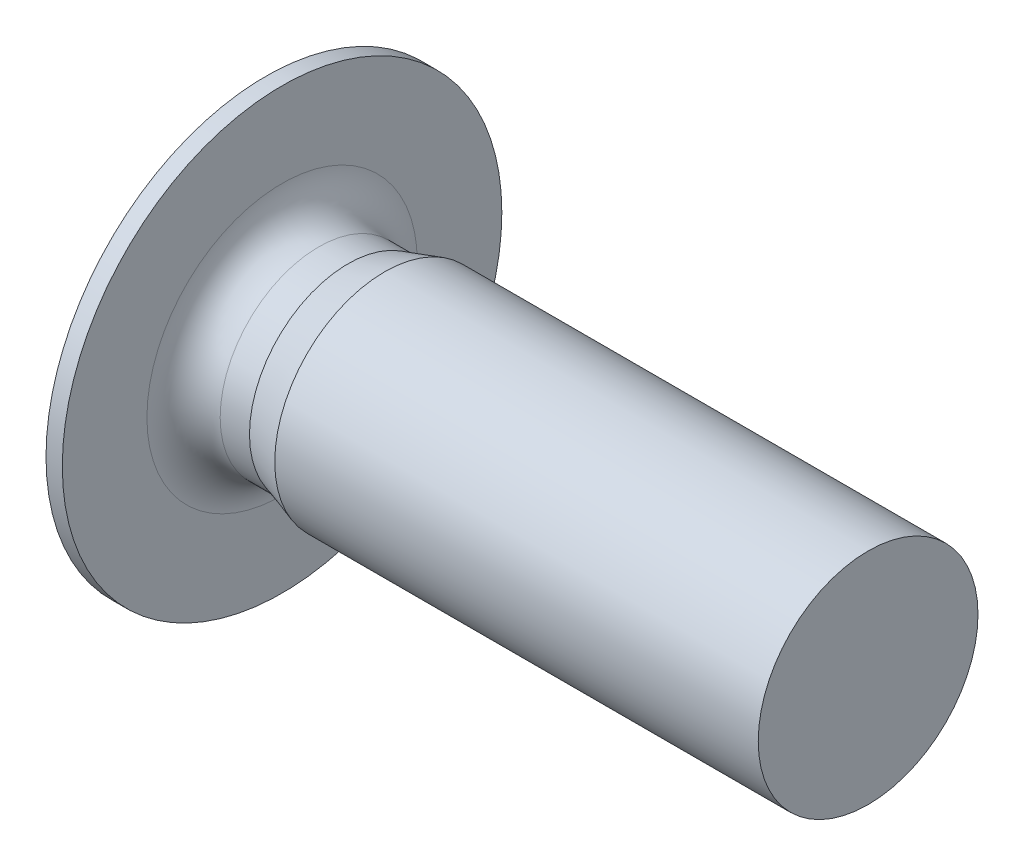
ISO-10303-21;
HEADER;
FILE_DESCRIPTION(('STEP AP214'),'2;1');
FILE_NAME('part.step','',(''),(''),'','','');
FILE_SCHEMA(('AUTOMOTIVE_DESIGN { 1 0 10303 214 1 1 1 1 }'));
ENDSEC;
DATA;
#1=APPLICATION_CONTEXT('core data for automotive mechanical design processes');
#2=APPLICATION_PROTOCOL_DEFINITION('international standard','automotive_design',2000,#1);
#3=PRODUCT_CONTEXT('',#1,'mechanical');
#4=PRODUCT('Part','Part','',(#3));
#5=PRODUCT_RELATED_PRODUCT_CATEGORY('part','',(#4));
#6=PRODUCT_DEFINITION_FORMATION('','',#4);
#7=PRODUCT_DEFINITION_CONTEXT('part definition',#1,'design');
#8=PRODUCT_DEFINITION('design','',#6,#7);
#9=PRODUCT_DEFINITION_SHAPE('','',#8);
#10=(LENGTH_UNIT() NAMED_UNIT(*) SI_UNIT(.MILLI.,.METRE.));
#11=(NAMED_UNIT(*) PLANE_ANGLE_UNIT() SI_UNIT($,.RADIAN.));
#12=(NAMED_UNIT(*) SI_UNIT($,.STERADIAN.) SOLID_ANGLE_UNIT());
#13=UNCERTAINTY_MEASURE_WITH_UNIT(LENGTH_MEASURE(1.E-05),#10,'distance_accuracy_value','');
#14=(GEOMETRIC_REPRESENTATION_CONTEXT(3) GLOBAL_UNCERTAINTY_ASSIGNED_CONTEXT((#13)) GLOBAL_UNIT_ASSIGNED_CONTEXT((#10,
#11,#12)) REPRESENTATION_CONTEXT('',''));
#15=CARTESIAN_POINT('',(0.,0.,0.));
#16=DIRECTION('',(0.,0.,1.));
#17=DIRECTION('',(1.,0.,0.));
#18=AXIS2_PLACEMENT_3D('',#15,#16,#17);
#19=CARTESIAN_POINT('',(0.5,0.,0.));
#20=DIRECTION('',(-1.,0.,0.));
#21=DIRECTION('',(0.,0.,1.));
#22=AXIS2_PLACEMENT_3D('',#19,#20,#21);
#23=TOROIDAL_SURFACE('',#22,1.845,0.5);
#24=CARTESIAN_POINT('',(0.5,0.,0.));
#25=DIRECTION('',(1.,0.,0.));
#26=DIRECTION('',(0.,0.,1.));
#27=AXIS2_PLACEMENT_3D('',#24,#25,#26);
#28=CIRCLE('',#27,1.345);
#29=CARTESIAN_POINT('',(0.5,0.,1.345));
#30=VERTEX_POINT('',#29);
#31=EDGE_CURVE('E259',#30,#30,#28,.T.);
#32=ORIENTED_EDGE('',*,*,#31,.F.);
#33=EDGE_LOOP('',(#32));
#34=FACE_BOUND('',#33,.T.);
#35=CARTESIAN_POINT('',(0.,0.,0.));
#36=DIRECTION('',(-1.,0.,0.));
#37=DIRECTION('',(0.,0.,1.));
#38=AXIS2_PLACEMENT_3D('',#35,#36,#37);
#39=CIRCLE('',#38,1.845);
#40=CARTESIAN_POINT('',(0.,0.,1.845));
#41=VERTEX_POINT('',#40);
#42=EDGE_CURVE('E215',#41,#41,#39,.T.);
#43=ORIENTED_EDGE('',*,*,#42,.F.);
#44=EDGE_LOOP('',(#43));
#45=FACE_BOUND('',#44,.T.);
#46=ADVANCED_FACE('F16',(#34,#45),#23,.F.);
#47=CARTESIAN_POINT('',(0.2,0.,0.));
#48=DIRECTION('',(-1.,0.,0.));
#49=DIRECTION('',(0.,-1.,0.));
#50=AXIS2_PLACEMENT_3D('',#47,#48,#49);
#51=CONICAL_SURFACE('',#50,0.75,1.02974425867665);
#52=CARTESIAN_POINT('',(0.650645464270675,0.,0.));
#53=VERTEX_POINT('',#52);
#54=VERTEX_LOOP('',#53);
#55=FACE_BOUND('',#54,.T.);
#56=CARTESIAN_POINT('',(0.2,0.,0.));
#57=DIRECTION('',(1.,0.,0.));
#58=DIRECTION('',(0.,1.,0.));
#59=AXIS2_PLACEMENT_3D('',#56,#57,#58);
#60=CIRCLE('',#59,0.75);
#61=CARTESIAN_POINT('',(0.2,0.75,0.));
#62=VERTEX_POINT('',#61);
#63=CARTESIAN_POINT('',(0.2,0.375,0.649519052838329));
#64=VERTEX_POINT('',#63);
#65=EDGE_CURVE('E227',#62,#64,#60,.T.);
#66=ORIENTED_EDGE('',*,*,#65,.F.);
#67=CARTESIAN_POINT('',(0.2,0.,0.));
#68=DIRECTION('',(1.,0.,0.));
#69=DIRECTION('',(0.,0.,1.));
#70=AXIS2_PLACEMENT_3D('',#67,#68,#69);
#71=CIRCLE('',#70,0.75);
#72=CARTESIAN_POINT('',(0.2,0.375,-0.649519052838329));
#73=VERTEX_POINT('',#72);
#74=EDGE_CURVE('E178',#73,#62,#71,.T.);
#75=ORIENTED_EDGE('',*,*,#74,.F.);
#76=CARTESIAN_POINT('',(0.2,0.,0.));
#77=DIRECTION('',(1.,0.,0.));
#78=DIRECTION('',(0.,0.,1.));
#79=AXIS2_PLACEMENT_3D('',#76,#77,#78);
#80=CIRCLE('',#79,0.75);
#81=CARTESIAN_POINT('',(0.2,-0.375,-0.649519052838329));
#82=VERTEX_POINT('',#81);
#83=EDGE_CURVE('E177',#82,#73,#80,.T.);
#84=ORIENTED_EDGE('',*,*,#83,.F.);
#85=CARTESIAN_POINT('',(0.2,0.,0.));
#86=DIRECTION('',(1.,0.,0.));
#87=DIRECTION('',(0.,0.,1.));
#88=AXIS2_PLACEMENT_3D('',#85,#86,#87);
#89=CIRCLE('',#88,0.75);
#90=CARTESIAN_POINT('',(0.2,-0.75,0.));
#91=VERTEX_POINT('',#90);
#92=EDGE_CURVE('E197',#91,#82,#89,.T.);
#93=ORIENTED_EDGE('',*,*,#92,.F.);
#94=CARTESIAN_POINT('',(0.2,0.,0.));
#95=DIRECTION('',(1.,0.,0.));
#96=DIRECTION('',(0.,0.,1.));
#97=AXIS2_PLACEMENT_3D('',#94,#95,#96);
#98=CIRCLE('',#97,0.75);
#99=CARTESIAN_POINT('',(0.2,-0.375,0.649519052838329));
#100=VERTEX_POINT('',#99);
#101=EDGE_CURVE('E163',#100,#91,#98,.T.);
#102=ORIENTED_EDGE('',*,*,#101,.F.);
#103=CARTESIAN_POINT('',(0.2,0.,0.));
#104=DIRECTION('',(1.,0.,0.));
#105=DIRECTION('',(0.,0.,1.));
#106=AXIS2_PLACEMENT_3D('',#103,#104,#105);
#107=CIRCLE('',#106,0.75);
#108=EDGE_CURVE('E10',#64,#100,#107,.T.);
#109=ORIENTED_EDGE('',*,*,#108,.F.);
#110=EDGE_LOOP('',(#66,#75,#84,#93,#102,#109));
#111=FACE_BOUND('',#110,.T.);
#112=ADVANCED_FACE('F310',(#55,#111),#51,.F.);
#113=CARTESIAN_POINT('',(0.2,0.,0.));
#114=DIRECTION('',(-1.,0.,0.));
#115=DIRECTION('',(0.,0.,1.));
#116=AXIS2_PLACEMENT_3D('',#113,#114,#115);
#117=PLANE('',#116);
#118=DIRECTION('',(0.,0.866025403784439,-0.5));
#119=VECTOR('',#118,1.);
#120=CARTESIAN_POINT('',(0.2,0.,0.866025403784439));
#121=LINE('',#120,#119);
#122=CARTESIAN_POINT('',(0.2,0.,0.866025403784439));
#123=VERTEX_POINT('',#122);
#124=EDGE_CURVE('E275',#123,#64,#121,.T.);
#125=ORIENTED_EDGE('',*,*,#124,.T.);
#126=ORIENTED_EDGE('',*,*,#108,.T.);
#127=DIRECTION('',(0.,0.866025403784439,0.5));
#128=VECTOR('',#127,1.);
#129=CARTESIAN_POINT('',(0.2,-0.75,0.433012701892219));
#130=LINE('',#129,#128);
#131=EDGE_CURVE('E39',#100,#123,#130,.T.);
#132=ORIENTED_EDGE('',*,*,#131,.T.);
#133=EDGE_LOOP('',(#125,#126,#132));
#134=FACE_BOUND('',#133,.T.);
#135=ADVANCED_FACE('F308',(#134),#117,.T.);
#136=CARTESIAN_POINT('',(0.2,0.,-0.866025403784439));
#137=DIRECTION('',(0.,-0.5,-0.866025403784439));
#138=DIRECTION('',(0.,-0.866025403784439,0.5));
#139=AXIS2_PLACEMENT_3D('',#136,#137,#138);
#140=PLANE('',#139);
#141=DIRECTION('',(0.,-0.866025403784439,0.5));
#142=VECTOR('',#141,1.);
#143=CARTESIAN_POINT('',(-0.8,0.,-0.866025403784439));
#144=LINE('',#143,#142);
#145=CARTESIAN_POINT('',(-0.8,0.,-0.866025403784439));
#146=VERTEX_POINT('',#145);
#147=CARTESIAN_POINT('',(-0.8,-0.75,-0.43301270189222));
#148=VERTEX_POINT('',#147);
#149=EDGE_CURVE('E191',#146,#148,#144,.T.);
#150=ORIENTED_EDGE('',*,*,#149,.T.);
#151=DIRECTION('',(-1.,0.,0.));
#152=VECTOR('',#151,1.);
#153=CARTESIAN_POINT('',(0.2,-0.75,-0.43301270189222));
#154=LINE('',#153,#152);
#155=CARTESIAN_POINT('',(0.2,-0.75,-0.43301270189222));
#156=VERTEX_POINT('',#155);
#157=EDGE_CURVE('E24',#156,#148,#154,.T.);
#158=ORIENTED_EDGE('',*,*,#157,.F.);
#159=DIRECTION('',(0.,-0.866025403784439,0.5));
#160=VECTOR('',#159,1.);
#161=CARTESIAN_POINT('',(0.2,0.,-0.866025403784439));
#162=LINE('',#161,#160);
#163=EDGE_CURVE('E193',#82,#156,#162,.T.);
#164=ORIENTED_EDGE('',*,*,#163,.F.);
#165=DIRECTION('',(0.,-0.866025403784439,0.5));
#166=VECTOR('',#165,1.);
#167=CARTESIAN_POINT('',(0.2,0.,-0.866025403784439));
#168=LINE('',#167,#166);
#169=CARTESIAN_POINT('',(0.2,0.,-0.866025403784439));
#170=VERTEX_POINT('',#169);
#171=EDGE_CURVE('E196',#170,#82,#168,.T.);
#172=ORIENTED_EDGE('',*,*,#171,.F.);
#173=DIRECTION('',(-1.,0.,0.));
#174=VECTOR('',#173,1.);
#175=CARTESIAN_POINT('',(0.2,0.,-0.866025403784439));
#176=LINE('',#175,#174);
#177=EDGE_CURVE('E266',#170,#146,#176,.T.);
#178=ORIENTED_EDGE('',*,*,#177,.T.);
#179=EDGE_LOOP('',(#150,#158,#164,#172,#178));
#180=FACE_BOUND('',#179,.T.);
#181=ADVANCED_FACE('F293',(#180),#140,.F.);
#182=CARTESIAN_POINT('',(0.2,-0.75,-0.43301270189222));
#183=DIRECTION('',(0.,-1.,0.));
#184=DIRECTION('',(0.,0.,-1.));
#185=AXIS2_PLACEMENT_3D('',#182,#183,#184);
#186=PLANE('',#185);
#187=DIRECTION('',(0.,0.,1.));
#188=VECTOR('',#187,1.);
#189=CARTESIAN_POINT('',(-0.8,-0.75,-0.43301270189222));
#190=LINE('',#189,#188);
#191=CARTESIAN_POINT('',(-0.8,-0.75,0.433012701892219));
#192=VERTEX_POINT('',#191);
#193=EDGE_CURVE('E151',#148,#192,#190,.T.);
#194=ORIENTED_EDGE('',*,*,#193,.T.);
#195=DIRECTION('',(-1.,0.,0.));
#196=VECTOR('',#195,1.);
#197=CARTESIAN_POINT('',(0.2,-0.75,0.433012701892219));
#198=LINE('',#197,#196);
#199=CARTESIAN_POINT('',(0.2,-0.75,0.433012701892219));
#200=VERTEX_POINT('',#199);
#201=EDGE_CURVE('E144',#200,#192,#198,.T.);
#202=ORIENTED_EDGE('',*,*,#201,.F.);
#203=DIRECTION('',(0.,0.,1.));
#204=VECTOR('',#203,1.);
#205=CARTESIAN_POINT('',(0.2,-0.75,-0.43301270189222));
#206=LINE('',#205,#204);
#207=EDGE_CURVE('E148',#91,#200,#206,.T.);
#208=ORIENTED_EDGE('',*,*,#207,.F.);
#209=DIRECTION('',(0.,0.,1.));
#210=VECTOR('',#209,1.);
#211=CARTESIAN_POINT('',(0.2,-0.75,-0.43301270189222));
#212=LINE('',#211,#210);
#213=EDGE_CURVE('E165',#156,#91,#212,.T.);
#214=ORIENTED_EDGE('',*,*,#213,.F.);
#215=ORIENTED_EDGE('',*,*,#157,.T.);
#216=EDGE_LOOP('',(#194,#202,#208,#214,#215));
#217=FACE_BOUND('',#216,.T.);
#218=ADVANCED_FACE('F146',(#217),#186,.F.);
#219=CARTESIAN_POINT('',(0.2,-0.75,0.433012701892219));
#220=DIRECTION('',(0.,-0.5,0.866025403784439));
#221=DIRECTION('',(-1.,0.,0.));
#222=AXIS2_PLACEMENT_3D('',#219,#220,#221);
#223=PLANE('',#222);
#224=DIRECTION('',(0.,0.866025403784439,0.5));
#225=VECTOR('',#224,1.);
#226=CARTESIAN_POINT('',(-0.8,-0.75,0.433012701892219));
#227=LINE('',#226,#225);
#228=CARTESIAN_POINT('',(-0.8,0.,0.866025403784439));
#229=VERTEX_POINT('',#228);
#230=EDGE_CURVE('E249',#192,#229,#227,.T.);
#231=ORIENTED_EDGE('',*,*,#230,.T.);
#232=DIRECTION('',(-1.,0.,0.));
#233=VECTOR('',#232,1.);
#234=CARTESIAN_POINT('',(0.2,0.,0.866025403784439));
#235=LINE('',#234,#233);
#236=EDGE_CURVE('E278',#123,#229,#235,.T.);
#237=ORIENTED_EDGE('',*,*,#236,.F.);
#238=ORIENTED_EDGE('',*,*,#131,.F.);
#239=DIRECTION('',(0.,0.866025403784439,0.5));
#240=VECTOR('',#239,1.);
#241=CARTESIAN_POINT('',(0.2,-0.75,0.433012701892219));
#242=LINE('',#241,#240);
#243=EDGE_CURVE('E161',#200,#100,#242,.T.);
#244=ORIENTED_EDGE('',*,*,#243,.F.);
#245=ORIENTED_EDGE('',*,*,#201,.T.);
#246=EDGE_LOOP('',(#231,#237,#238,#244,#245));
#247=FACE_BOUND('',#246,.T.);
#248=ADVANCED_FACE('F167',(#247),#223,.F.);
#249=CARTESIAN_POINT('',(0.2,0.,0.866025403784439));
#250=DIRECTION('',(0.,0.5,0.866025403784439));
#251=DIRECTION('',(1.,0.,0.));
#252=AXIS2_PLACEMENT_3D('',#249,#250,#251);
#253=PLANE('',#252);
#254=DIRECTION('',(0.,0.866025403784439,-0.5));
#255=VECTOR('',#254,1.);
#256=CARTESIAN_POINT('',(-0.8,0.,0.866025403784439));
#257=LINE('',#256,#255);
#258=CARTESIAN_POINT('',(-0.8,0.75,0.43301270189222));
#259=VERTEX_POINT('',#258);
#260=EDGE_CURVE('E245',#229,#259,#257,.T.);
#261=ORIENTED_EDGE('',*,*,#260,.T.);
#262=DIRECTION('',(-1.,0.,0.));
#263=VECTOR('',#262,1.);
#264=CARTESIAN_POINT('',(0.2,0.75,0.43301270189222));
#265=LINE('',#264,#263);
#266=CARTESIAN_POINT('',(0.2,0.75,0.43301270189222));
#267=VERTEX_POINT('',#266);
#268=EDGE_CURVE('E272',#267,#259,#265,.T.);
#269=ORIENTED_EDGE('',*,*,#268,.F.);
#270=DIRECTION('',(0.,0.866025403784439,-0.5));
#271=VECTOR('',#270,1.);
#272=CARTESIAN_POINT('',(0.2,0.,0.866025403784439));
#273=LINE('',#272,#271);
#274=EDGE_CURVE('E192',#64,#267,#273,.T.);
#275=ORIENTED_EDGE('',*,*,#274,.F.);
#276=ORIENTED_EDGE('',*,*,#124,.F.);
#277=ORIENTED_EDGE('',*,*,#236,.T.);
#278=EDGE_LOOP('',(#261,#269,#275,#276,#277));
#279=FACE_BOUND('',#278,.T.);
#280=ADVANCED_FACE('F306',(#279),#253,.F.);
#281=CARTESIAN_POINT('',(0.2,0.75,0.43301270189222));
#282=DIRECTION('',(0.,1.,0.));
#283=DIRECTION('',(1.,0.,0.));
#284=AXIS2_PLACEMENT_3D('',#281,#282,#283);
#285=PLANE('',#284);
#286=DIRECTION('',(0.,0.,-1.));
#287=VECTOR('',#286,1.);
#288=CARTESIAN_POINT('',(-0.8,0.75,0.43301270189222));
#289=LINE('',#288,#287);
#290=CARTESIAN_POINT('',(-0.8,0.75,-0.43301270189222));
#291=VERTEX_POINT('',#290);
#292=EDGE_CURVE('E241',#259,#291,#289,.T.);
#293=ORIENTED_EDGE('',*,*,#292,.T.);
#294=DIRECTION('',(-1.,0.,0.));
#295=VECTOR('',#294,1.);
#296=CARTESIAN_POINT('',(0.2,0.75,-0.43301270189222));
#297=LINE('',#296,#295);
#298=CARTESIAN_POINT('',(0.2,0.75,-0.43301270189222));
#299=VERTEX_POINT('',#298);
#300=EDGE_CURVE('E269',#299,#291,#297,.T.);
#301=ORIENTED_EDGE('',*,*,#300,.F.);
#302=DIRECTION('',(0.,0.,-1.));
#303=VECTOR('',#302,1.);
#304=CARTESIAN_POINT('',(0.2,0.75,0.43301270189222));
#305=LINE('',#304,#303);
#306=EDGE_CURVE('E182',#62,#299,#305,.T.);
#307=ORIENTED_EDGE('',*,*,#306,.F.);
#308=DIRECTION('',(0.,0.,-1.));
#309=VECTOR('',#308,1.);
#310=CARTESIAN_POINT('',(0.2,0.75,0.43301270189222));
#311=LINE('',#310,#309);
#312=EDGE_CURVE('E223',#267,#62,#311,.T.);
#313=ORIENTED_EDGE('',*,*,#312,.F.);
#314=ORIENTED_EDGE('',*,*,#268,.T.);
#315=EDGE_LOOP('',(#293,#301,#307,#313,#314));
#316=FACE_BOUND('',#315,.T.);
#317=ADVANCED_FACE('F301',(#316),#285,.F.);
#318=CARTESIAN_POINT('',(0.2,0.75,-0.43301270189222));
#319=DIRECTION('',(0.,0.5,-0.866025403784439));
#320=DIRECTION('',(-1.,0.,0.));
#321=AXIS2_PLACEMENT_3D('',#318,#319,#320);
#322=PLANE('',#321);
#323=DIRECTION('',(0.,-0.866025403784439,-0.5));
#324=VECTOR('',#323,1.);
#325=CARTESIAN_POINT('',(-0.8,0.75,-0.43301270189222));
#326=LINE('',#325,#324);
#327=EDGE_CURVE('E237',#291,#146,#326,.T.);
#328=ORIENTED_EDGE('',*,*,#327,.T.);
#329=ORIENTED_EDGE('',*,*,#177,.F.);
#330=DIRECTION('',(0.,-0.866025403784439,-0.5));
#331=VECTOR('',#330,1.);
#332=CARTESIAN_POINT('',(0.2,0.75,-0.43301270189222));
#333=LINE('',#332,#331);
#334=EDGE_CURVE('E208',#73,#170,#333,.T.);
#335=ORIENTED_EDGE('',*,*,#334,.F.);
#336=DIRECTION('',(0.,-0.866025403784439,-0.5));
#337=VECTOR('',#336,1.);
#338=CARTESIAN_POINT('',(0.2,0.75,-0.43301270189222));
#339=LINE('',#338,#337);
#340=EDGE_CURVE('E183',#299,#73,#339,.T.);
#341=ORIENTED_EDGE('',*,*,#340,.F.);
#342=ORIENTED_EDGE('',*,*,#300,.T.);
#343=EDGE_LOOP('',(#328,#329,#335,#341,#342));
#344=FACE_BOUND('',#343,.T.);
#345=ADVANCED_FACE('F297',(#344),#322,.F.);
#346=CARTESIAN_POINT('',(-0.222649730810374,0.,0.));
#347=DIRECTION('',(1.,0.,0.));
#348=DIRECTION('',(0.,0.,-1.));
#349=AXIS2_PLACEMENT_3D('',#346,#347,#348);
#350=CONICAL_SURFACE('',#349,3.,1.0471975511966);
#351=CARTESIAN_POINT('',(-0.8,0.,0.));
#352=DIRECTION('',(-1.,0.,0.));
#353=DIRECTION('',(0.,0.,1.));
#354=AXIS2_PLACEMENT_3D('',#351,#352,#353);
#355=CIRCLE('',#354,2.);
#356=CARTESIAN_POINT('',(-0.8,0.,2.));
#357=VERTEX_POINT('',#356);
#358=EDGE_CURVE('E188',#357,#357,#355,.T.);
#359=ORIENTED_EDGE('',*,*,#358,.F.);
#360=EDGE_LOOP('',(#359));
#361=FACE_BOUND('',#360,.T.);
#362=CARTESIAN_POINT('',(-0.222649730810374,0.,0.));
#363=DIRECTION('',(-1.,0.,0.));
#364=DIRECTION('',(0.,0.,1.));
#365=AXIS2_PLACEMENT_3D('',#362,#363,#364);
#366=CIRCLE('',#365,3.);
#367=CARTESIAN_POINT('',(-0.222649730810374,0.,3.));
#368=VERTEX_POINT('',#367);
#369=EDGE_CURVE('E218',#368,#368,#366,.T.);
#370=ORIENTED_EDGE('',*,*,#369,.T.);
#371=EDGE_LOOP('',(#370));
#372=FACE_BOUND('',#371,.T.);
#373=ADVANCED_FACE('F345',(#361,#372),#350,.T.);
#374=CARTESIAN_POINT('',(-0.8,0.,0.));
#375=DIRECTION('',(-1.,0.,0.));
#376=DIRECTION('',(0.,0.,1.));
#377=AXIS2_PLACEMENT_3D('',#374,#375,#376);
#378=CYLINDRICAL_SURFACE('',#377,3.);
#379=ORIENTED_EDGE('',*,*,#369,.F.);
#380=EDGE_LOOP('',(#379));
#381=FACE_BOUND('',#380,.T.);
#382=CARTESIAN_POINT('',(0.,0.,0.));
#383=DIRECTION('',(-1.,0.,0.));
#384=DIRECTION('',(0.,0.,1.));
#385=AXIS2_PLACEMENT_3D('',#382,#383,#384);
#386=CIRCLE('',#385,3.);
#387=CARTESIAN_POINT('',(0.,0.,3.));
#388=VERTEX_POINT('',#387);
#389=EDGE_CURVE('E219',#388,#388,#386,.T.);
#390=ORIENTED_EDGE('',*,*,#389,.T.);
#391=EDGE_LOOP('',(#390));
#392=FACE_BOUND('',#391,.T.);
#393=ADVANCED_FACE('F341',(#381,#392),#378,.T.);
#394=CARTESIAN_POINT('',(0.,1.345,0.));
#395=DIRECTION('',(-1.,0.,0.));
#396=DIRECTION('',(0.,0.,1.));
#397=AXIS2_PLACEMENT_3D('',#394,#395,#396);
#398=PLANE('',#397);
#399=ORIENTED_EDGE('',*,*,#42,.T.);
#400=EDGE_LOOP('',(#399));
#401=FACE_BOUND('',#400,.T.);
#402=ORIENTED_EDGE('',*,*,#389,.F.);
#403=EDGE_LOOP('',(#402));
#404=FACE_BOUND('',#403,.T.);
#405=ADVANCED_FACE('F337',(#401,#404),#398,.F.);
#406=CARTESIAN_POINT('',(-0.8,0.,0.));
#407=DIRECTION('',(-1.,0.,0.));
#408=DIRECTION('',(0.,0.,1.));
#409=AXIS2_PLACEMENT_3D('',#406,#407,#408);
#410=CYLINDRICAL_SURFACE('',#409,1.345);
#411=ORIENTED_EDGE('',*,*,#31,.T.);
#412=EDGE_LOOP('',(#411));
#413=FACE_BOUND('',#412,.T.);
#414=CARTESIAN_POINT('',(0.9,0.,0.));
#415=DIRECTION('',(-1.,0.,0.));
#416=DIRECTION('',(0.,0.,1.));
#417=AXIS2_PLACEMENT_3D('',#414,#415,#416);
#418=CIRCLE('',#417,1.345);
#419=CARTESIAN_POINT('',(0.9,0.,1.345));
#420=VERTEX_POINT('',#419);
#421=EDGE_CURVE('E256',#420,#420,#418,.T.);
#422=ORIENTED_EDGE('',*,*,#421,.T.);
#423=EDGE_LOOP('',(#422));
#424=FACE_BOUND('',#423,.T.);
#425=ADVANCED_FACE('F340',(#413,#424),#410,.T.);
#426=CARTESIAN_POINT('',(1.4,0.,0.));
#427=DIRECTION('',(1.,0.,0.));
#428=DIRECTION('',(0.,0.,-1.));
#429=AXIS2_PLACEMENT_3D('',#426,#427,#428);
#430=CONICAL_SURFACE('',#429,1.5,0.300605670042395);
#431=ORIENTED_EDGE('',*,*,#421,.F.);
#432=EDGE_LOOP('',(#431));
#433=FACE_BOUND('',#432,.T.);
#434=CARTESIAN_POINT('',(1.4,0.,0.));
#435=DIRECTION('',(-1.,0.,0.));
#436=DIRECTION('',(0.,0.,1.));
#437=AXIS2_PLACEMENT_3D('',#434,#435,#436);
#438=CIRCLE('',#437,1.5);
#439=CARTESIAN_POINT('',(1.4,0.,1.5));
#440=VERTEX_POINT('',#439);
#441=EDGE_CURVE('E186',#440,#440,#438,.T.);
#442=ORIENTED_EDGE('',*,*,#441,.T.);
#443=EDGE_LOOP('',(#442));
#444=FACE_BOUND('',#443,.T.);
#445=ADVANCED_FACE('F439',(#433,#444),#430,.T.);
#446=CARTESIAN_POINT('',(-0.8,0.,0.));
#447=DIRECTION('',(-1.,0.,0.));
#448=DIRECTION('',(0.,0.,1.));
#449=AXIS2_PLACEMENT_3D('',#446,#447,#448);
#450=CYLINDRICAL_SURFACE('',#449,1.5);
#451=ORIENTED_EDGE('',*,*,#441,.F.);
#452=EDGE_LOOP('',(#451));
#453=FACE_BOUND('',#452,.T.);
#454=CARTESIAN_POINT('',(8.,0.,0.));
#455=DIRECTION('',(-1.,0.,0.));
#456=DIRECTION('',(0.,0.,1.));
#457=AXIS2_PLACEMENT_3D('',#454,#455,#456);
#458=CIRCLE('',#457,1.5);
#459=CARTESIAN_POINT('',(8.,0.,1.5));
#460=VERTEX_POINT('',#459);
#461=EDGE_CURVE('E184',#460,#460,#458,.T.);
#462=ORIENTED_EDGE('',*,*,#461,.T.);
#463=EDGE_LOOP('',(#462));
#464=FACE_BOUND('',#463,.T.);
#465=ADVANCED_FACE('F449',(#453,#464),#450,.T.);
#466=CARTESIAN_POINT('',(8.,0.,0.));
#467=DIRECTION('',(-1.,0.,0.));
#468=DIRECTION('',(0.,0.,1.));
#469=AXIS2_PLACEMENT_3D('',#466,#467,#468);
#470=PLANE('',#469);
#471=ORIENTED_EDGE('',*,*,#461,.F.);
#472=EDGE_LOOP('',(#471));
#473=FACE_BOUND('',#472,.T.);
#474=ADVANCED_FACE('F459',(#473),#470,.F.);
#475=CARTESIAN_POINT('',(-0.8,2.,0.));
#476=DIRECTION('',(1.,0.,0.));
#477=DIRECTION('',(0.,1.,0.));
#478=AXIS2_PLACEMENT_3D('',#475,#476,#477);
#479=PLANE('',#478);
#480=ORIENTED_EDGE('',*,*,#149,.F.);
#481=ORIENTED_EDGE('',*,*,#327,.F.);
#482=ORIENTED_EDGE('',*,*,#292,.F.);
#483=ORIENTED_EDGE('',*,*,#260,.F.);
#484=ORIENTED_EDGE('',*,*,#230,.F.);
#485=ORIENTED_EDGE('',*,*,#193,.F.);
#486=EDGE_LOOP('',(#480,#481,#482,#483,#484,#485));
#487=FACE_BOUND('',#486,.T.);
#488=ORIENTED_EDGE('',*,*,#358,.T.);
#489=EDGE_LOOP('',(#488));
#490=FACE_BOUND('',#489,.T.);
#491=ADVANCED_FACE('F289',(#487,#490),#479,.F.);
#492=CARTESIAN_POINT('',(0.2,0.,0.));
#493=DIRECTION('',(-1.,0.,0.));
#494=DIRECTION('',(0.,0.,1.));
#495=AXIS2_PLACEMENT_3D('',#492,#493,#494);
#496=PLANE('',#495);
#497=ORIENTED_EDGE('',*,*,#312,.T.);
#498=ORIENTED_EDGE('',*,*,#65,.T.);
#499=ORIENTED_EDGE('',*,*,#274,.T.);
#500=EDGE_LOOP('',(#497,#498,#499));
#501=FACE_BOUND('',#500,.T.);
#502=ADVANCED_FACE('F482',(#501),#496,.T.);
#503=CARTESIAN_POINT('',(0.2,0.,0.));
#504=DIRECTION('',(-1.,0.,0.));
#505=DIRECTION('',(0.,0.,1.));
#506=AXIS2_PLACEMENT_3D('',#503,#504,#505);
#507=PLANE('',#506);
#508=ORIENTED_EDGE('',*,*,#340,.T.);
#509=ORIENTED_EDGE('',*,*,#74,.T.);
#510=ORIENTED_EDGE('',*,*,#306,.T.);
#511=EDGE_LOOP('',(#508,#509,#510));
#512=FACE_BOUND('',#511,.T.);
#513=ADVANCED_FACE('F323',(#512),#507,.T.);
#514=CARTESIAN_POINT('',(0.2,0.,0.));
#515=DIRECTION('',(-1.,0.,0.));
#516=DIRECTION('',(0.,0.,1.));
#517=AXIS2_PLACEMENT_3D('',#514,#515,#516);
#518=PLANE('',#517);
#519=ORIENTED_EDGE('',*,*,#171,.T.);
#520=ORIENTED_EDGE('',*,*,#83,.T.);
#521=ORIENTED_EDGE('',*,*,#334,.T.);
#522=EDGE_LOOP('',(#519,#520,#521));
#523=FACE_BOUND('',#522,.T.);
#524=ADVANCED_FACE('F315',(#523),#518,.T.);
#525=CARTESIAN_POINT('',(0.2,0.,0.));
#526=DIRECTION('',(-1.,0.,0.));
#527=DIRECTION('',(0.,0.,1.));
#528=AXIS2_PLACEMENT_3D('',#525,#526,#527);
#529=PLANE('',#528);
#530=ORIENTED_EDGE('',*,*,#213,.T.);
#531=ORIENTED_EDGE('',*,*,#92,.T.);
#532=ORIENTED_EDGE('',*,*,#163,.T.);
#533=EDGE_LOOP('',(#530,#531,#532));
#534=FACE_BOUND('',#533,.T.);
#535=ADVANCED_FACE('F313',(#534),#529,.T.);
#536=CARTESIAN_POINT('',(0.2,0.,0.));
#537=DIRECTION('',(-1.,0.,0.));
#538=DIRECTION('',(0.,0.,1.));
#539=AXIS2_PLACEMENT_3D('',#536,#537,#538);
#540=PLANE('',#539);
#541=ORIENTED_EDGE('',*,*,#243,.T.);
#542=ORIENTED_EDGE('',*,*,#101,.T.);
#543=ORIENTED_EDGE('',*,*,#207,.T.);
#544=EDGE_LOOP('',(#541,#542,#543));
#545=FACE_BOUND('',#544,.T.);
#546=ADVANCED_FACE('F160',(#545),#540,.T.);
#547=CLOSED_SHELL('',(#46,#112,#135,#181,#218,#248,#280,#317,#345,#373,#393,#405,#425,#445,#465,
#474,#491,#502,#513,#524,#535,#546));
#548=MANIFOLD_SOLID_BREP('B1',#547);
#549=ADVANCED_BREP_SHAPE_REPRESENTATION('',(#18,#548),#14);
#550=SHAPE_DEFINITION_REPRESENTATION(#9,#549);
ENDSEC;
END-ISO-10303-21;
